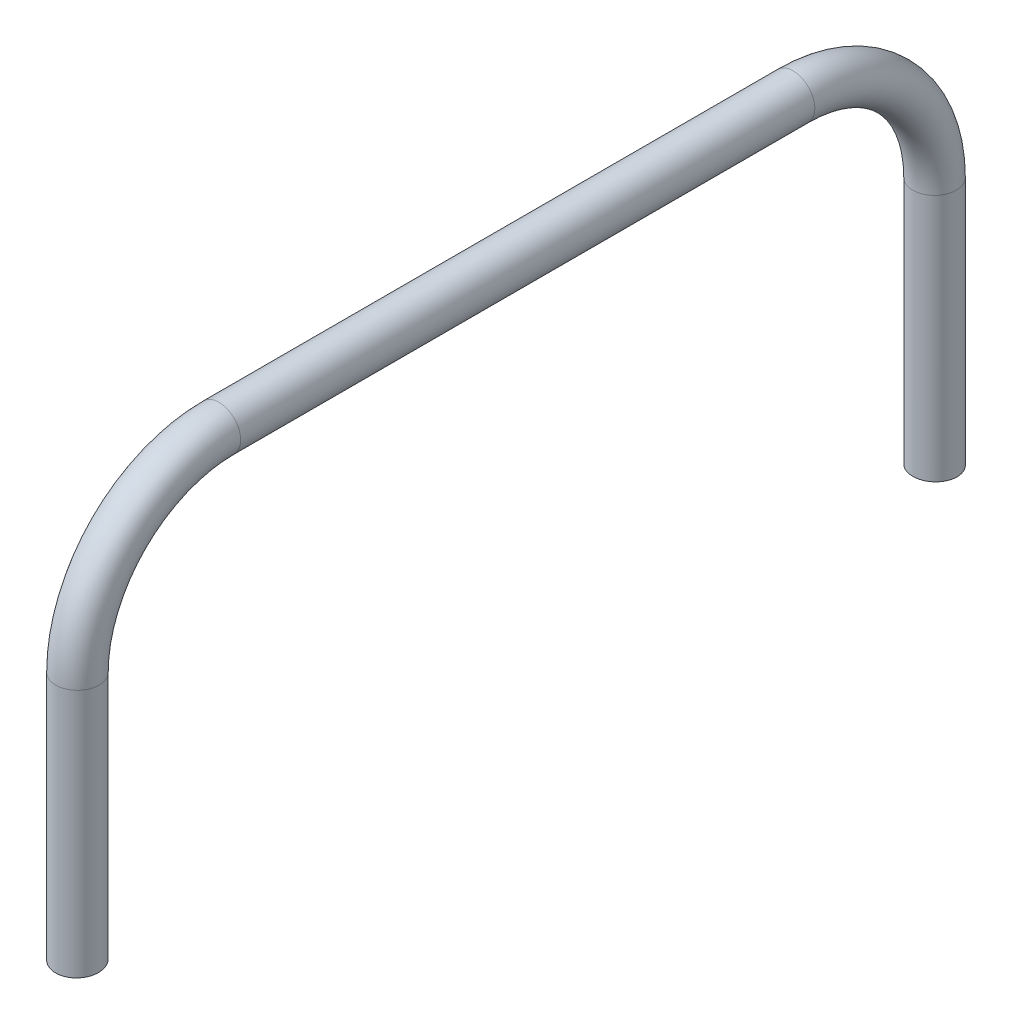
ISO-10303-21;
HEADER;
FILE_DESCRIPTION(('STEP AP214'),'2;1');
FILE_NAME('part.step','',(''),(''),'','','');
FILE_SCHEMA(('AUTOMOTIVE_DESIGN { 1 0 10303 214 1 1 1 1 }'));
ENDSEC;
DATA;
#1=APPLICATION_CONTEXT('core data for automotive mechanical design processes');
#2=APPLICATION_PROTOCOL_DEFINITION('international standard','automotive_design',2000,#1);
#3=PRODUCT_CONTEXT('',#1,'mechanical');
#4=PRODUCT('Part','Part','',(#3));
#5=PRODUCT_RELATED_PRODUCT_CATEGORY('part','',(#4));
#6=PRODUCT_DEFINITION_FORMATION('','',#4);
#7=PRODUCT_DEFINITION_CONTEXT('part definition',#1,'design');
#8=PRODUCT_DEFINITION('design','',#6,#7);
#9=PRODUCT_DEFINITION_SHAPE('','',#8);
#10=(LENGTH_UNIT() NAMED_UNIT(*) SI_UNIT(.MILLI.,.METRE.));
#11=(NAMED_UNIT(*) PLANE_ANGLE_UNIT() SI_UNIT($,.RADIAN.));
#12=(NAMED_UNIT(*) SI_UNIT($,.STERADIAN.) SOLID_ANGLE_UNIT());
#13=UNCERTAINTY_MEASURE_WITH_UNIT(LENGTH_MEASURE(1.E-05),#10,'distance_accuracy_value','');
#14=(GEOMETRIC_REPRESENTATION_CONTEXT(3) GLOBAL_UNCERTAINTY_ASSIGNED_CONTEXT((#13)) GLOBAL_UNIT_ASSIGNED_CONTEXT((#10,
#11,#12)) REPRESENTATION_CONTEXT('',''));
#15=CARTESIAN_POINT('',(0.,0.,0.));
#16=DIRECTION('',(0.,0.,1.));
#17=DIRECTION('',(1.,0.,0.));
#18=AXIS2_PLACEMENT_3D('',#15,#16,#17);
#19=CARTESIAN_POINT('',(899.999999999999,420.499546279117,-167.450000000002));
#20=DIRECTION('',(1.,0.,0.));
#21=DIRECTION('',(0.,0.,-1.));
#22=AXIS2_PLACEMENT_3D('',#19,#20,#21);
#23=TOROIDAL_SURFACE('',#22,82.5499999999968,9.65000000000003);
#24=CARTESIAN_POINT('',(899.999999999999,420.499546279127,-249.999999999998));
#25=DIRECTION('',(0.,1.,1.20409408209324E-13));
#26=DIRECTION('',(0.,-1.20409408209324E-13,1.));
#27=AXIS2_PLACEMENT_3D('',#24,#25,#26);
#28=CIRCLE('',#27,9.65000000000003);
#29=CARTESIAN_POINT('',(899.999999999999,420.499546279128,-259.649999999998));
#30=VERTEX_POINT('',#29);
#31=EDGE_CURVE('E80',#30,#30,#28,.T.);
#32=CARTESIAN_POINT('',(900.,503.049546279118,-167.450000000002));
#33=DIRECTION('',(0.,0.,-1.));
#34=DIRECTION('',(-1.,0.,0.));
#35=AXIS2_PLACEMENT_3D('',#32,#33,#34);
#36=CIRCLE('',#35,9.65000000000003);
#37=CARTESIAN_POINT('',(900.,512.699546279114,-167.450000000002));
#38=VERTEX_POINT('',#37);
#39=EDGE_CURVE('E41',#38,#38,#36,.T.);
#40=CARTESIAN_POINT('',(899.999999999999,420.499546279117,-167.450000000002));
#41=DIRECTION('',(1.,0.,0.));
#42=DIRECTION('',(0.,0.,-1.));
#43=AXIS2_PLACEMENT_3D('',#40,#41,#42);
#44=CIRCLE('',#43,92.1999999999968);
#45=EDGE_CURVE('',#30,#38,#44,.T.);
#46=ORIENTED_EDGE('',*,*,#31,.F.);
#47=ORIENTED_EDGE('',*,*,#39,.F.);
#48=ORIENTED_EDGE('',*,*,#45,.T.);
#49=ORIENTED_EDGE('',*,*,#45,.F.);
#50=EDGE_LOOP('',(#46,#48,#47,#49));
#51=FACE_BOUND('',#50,.T.);
#52=ADVANCED_FACE('F38',(#51),#23,.F.);
#53=CARTESIAN_POINT('',(899.999999999999,420.499546279117,-167.450000000002));
#54=DIRECTION('',(1.,0.,0.));
#55=DIRECTION('',(0.,0.,-1.));
#56=AXIS2_PLACEMENT_3D('',#53,#54,#55);
#57=TOROIDAL_SURFACE('',#56,82.5499999999968,12.7);
#58=CARTESIAN_POINT('',(899.999999999999,420.499546279127,-249.999999999998));
#59=DIRECTION('',(0.,1.,1.20409408209324E-13));
#60=DIRECTION('',(0.,-1.20409408209324E-13,1.));
#61=AXIS2_PLACEMENT_3D('',#58,#59,#60);
#62=CIRCLE('',#61,12.7);
#63=CARTESIAN_POINT('',(899.999999999999,420.499546279129,-262.699999999998));
#64=VERTEX_POINT('',#63);
#65=EDGE_CURVE('E79',#64,#64,#62,.T.);
#66=CARTESIAN_POINT('',(900.,503.049546279118,-167.450000000002));
#67=DIRECTION('',(0.,0.,-1.));
#68=DIRECTION('',(-1.,0.,0.));
#69=AXIS2_PLACEMENT_3D('',#66,#67,#68);
#70=CIRCLE('',#69,12.7);
#71=CARTESIAN_POINT('',(900.,515.749546279114,-167.450000000002));
#72=VERTEX_POINT('',#71);
#73=EDGE_CURVE('E10',#72,#72,#70,.T.);
#74=CARTESIAN_POINT('',(899.999999999999,420.499546279117,-167.450000000002));
#75=DIRECTION('',(1.,0.,0.));
#76=DIRECTION('',(0.,0.,-1.));
#77=AXIS2_PLACEMENT_3D('',#74,#75,#76);
#78=CIRCLE('',#77,95.2499999999968);
#79=EDGE_CURVE('',#64,#72,#78,.T.);
#80=ORIENTED_EDGE('',*,*,#65,.T.);
#81=ORIENTED_EDGE('',*,*,#73,.T.);
#82=ORIENTED_EDGE('',*,*,#79,.T.);
#83=ORIENTED_EDGE('',*,*,#79,.F.);
#84=EDGE_LOOP('',(#80,#82,#81,#83));
#85=FACE_BOUND('',#84,.T.);
#86=ADVANCED_FACE('F97',(#85),#57,.T.);
#87=CARTESIAN_POINT('',(900.,503.049546279118,167.449999999999));
#88=DIRECTION('',(0.,0.,-1.));
#89=DIRECTION('',(-1.,0.,0.));
#90=AXIS2_PLACEMENT_3D('',#87,#88,#89);
#91=CYLINDRICAL_SURFACE('',#90,9.65000000000003);
#92=CARTESIAN_POINT('',(900.,503.049546279118,167.449999999999));
#93=DIRECTION('',(0.,0.,-1.));
#94=DIRECTION('',(-1.,0.,0.));
#95=AXIS2_PLACEMENT_3D('',#92,#93,#94);
#96=CIRCLE('',#95,9.65000000000003);
#97=CARTESIAN_POINT('',(900.,512.699546279118,167.449999999999));
#98=VERTEX_POINT('',#97);
#99=EDGE_CURVE('E54',#98,#98,#96,.T.);
#100=ORIENTED_EDGE('',*,*,#99,.F.);
#101=EDGE_LOOP('',(#100));
#102=FACE_BOUND('',#101,.T.);
#103=ORIENTED_EDGE('',*,*,#39,.T.);
#104=EDGE_LOOP('',(#103));
#105=FACE_BOUND('',#104,.T.);
#106=ADVANCED_FACE('F103',(#102,#105),#91,.F.);
#107=CARTESIAN_POINT('',(900.,503.049546279118,167.449999999999));
#108=DIRECTION('',(0.,0.,-1.));
#109=DIRECTION('',(-1.,0.,0.));
#110=AXIS2_PLACEMENT_3D('',#107,#108,#109);
#111=CYLINDRICAL_SURFACE('',#110,12.7);
#112=CARTESIAN_POINT('',(900.,503.049546279118,167.449999999999));
#113=DIRECTION('',(0.,0.,1.));
#114=DIRECTION('',(1.,0.,0.));
#115=AXIS2_PLACEMENT_3D('',#112,#113,#114);
#116=CIRCLE('',#115,12.7);
#117=CARTESIAN_POINT('',(900.,515.749546279118,167.449999999999));
#118=VERTEX_POINT('',#117);
#119=EDGE_CURVE('E46',#118,#118,#116,.T.);
#120=ORIENTED_EDGE('',*,*,#119,.F.);
#121=EDGE_LOOP('',(#120));
#122=FACE_BOUND('',#121,.T.);
#123=ORIENTED_EDGE('',*,*,#73,.F.);
#124=EDGE_LOOP('',(#123));
#125=FACE_BOUND('',#124,.T.);
#126=ADVANCED_FACE('F109',(#122,#125),#111,.T.);
#127=CARTESIAN_POINT('',(900.,420.499546279117,167.449999999999));
#128=DIRECTION('',(1.,0.,0.));
#129=DIRECTION('',(0.,0.,-1.));
#130=AXIS2_PLACEMENT_3D('',#127,#128,#129);
#131=TOROIDAL_SURFACE('',#130,82.5500000000009,9.65000000000003);
#132=CARTESIAN_POINT('',(899.999999999999,420.499546279117,249.999999999998));
#133=DIRECTION('',(0.,1.,0.));
#134=DIRECTION('',(-1.,0.,0.));
#135=AXIS2_PLACEMENT_3D('',#132,#133,#134);
#136=CIRCLE('',#135,9.65000000000003);
#137=CARTESIAN_POINT('',(899.999999999999,420.499546279117,259.65));
#138=VERTEX_POINT('',#137);
#139=EDGE_CURVE('E63',#138,#138,#136,.T.);
#140=CARTESIAN_POINT('',(900.,420.499546279117,167.449999999999));
#141=DIRECTION('',(1.,0.,0.));
#142=DIRECTION('',(0.,0.,-1.));
#143=AXIS2_PLACEMENT_3D('',#140,#141,#142);
#144=CIRCLE('',#143,92.2000000000009);
#145=EDGE_CURVE('',#98,#138,#144,.T.);
#146=ORIENTED_EDGE('',*,*,#99,.T.);
#147=ORIENTED_EDGE('',*,*,#139,.F.);
#148=ORIENTED_EDGE('',*,*,#145,.T.);
#149=ORIENTED_EDGE('',*,*,#145,.F.);
#150=EDGE_LOOP('',(#146,#148,#147,#149));
#151=FACE_BOUND('',#150,.T.);
#152=ADVANCED_FACE('F116',(#151),#131,.F.);
#153=CARTESIAN_POINT('',(900.,420.499546279117,167.449999999999));
#154=DIRECTION('',(1.,0.,0.));
#155=DIRECTION('',(0.,0.,-1.));
#156=AXIS2_PLACEMENT_3D('',#153,#154,#155);
#157=TOROIDAL_SURFACE('',#156,82.5500000000009,12.7);
#158=CARTESIAN_POINT('',(899.999999999999,420.499546279117,249.999999999998));
#159=DIRECTION('',(0.,1.,0.));
#160=DIRECTION('',(-1.,0.,0.));
#161=AXIS2_PLACEMENT_3D('',#158,#159,#160);
#162=CIRCLE('',#161,12.7);
#163=CARTESIAN_POINT('',(899.999999999999,420.499546279117,262.7));
#164=VERTEX_POINT('',#163);
#165=EDGE_CURVE('E67',#164,#164,#162,.T.);
#166=CARTESIAN_POINT('',(900.,420.499546279117,167.449999999999));
#167=DIRECTION('',(1.,0.,0.));
#168=DIRECTION('',(0.,0.,-1.));
#169=AXIS2_PLACEMENT_3D('',#166,#167,#168);
#170=CIRCLE('',#169,95.2500000000009);
#171=EDGE_CURVE('',#118,#164,#170,.T.);
#172=ORIENTED_EDGE('',*,*,#119,.T.);
#173=ORIENTED_EDGE('',*,*,#165,.T.);
#174=ORIENTED_EDGE('',*,*,#171,.T.);
#175=ORIENTED_EDGE('',*,*,#171,.F.);
#176=EDGE_LOOP('',(#172,#174,#173,#175));
#177=FACE_BOUND('',#176,.T.);
#178=ADVANCED_FACE('F123',(#177),#157,.T.);
#179=CARTESIAN_POINT('',(899.999999999994,275.499546279119,249.999999999999));
#180=DIRECTION('',(0.,1.,0.));
#181=DIRECTION('',(-1.,0.,0.));
#182=AXIS2_PLACEMENT_3D('',#179,#180,#181);
#183=CYLINDRICAL_SURFACE('',#182,9.65000000000003);
#184=CARTESIAN_POINT('',(899.999999999994,275.499546279119,249.999999999999));
#185=DIRECTION('',(0.00229816078026698,0.999408736415618,0.0343059183402114));
#186=DIRECTION('',(-0.0668008812384672,0.0343828093112999,-0.997173738467689));
#187=AXIS2_PLACEMENT_3D('',#184,#185,#186);
#188=ELLIPSE('',#187,9.65570906915401,9.65000000000003);
#189=CARTESIAN_POINT('',(899.354990125192,275.831536682809,240.371580489954));
#190=VERTEX_POINT('',#189);
#191=EDGE_CURVE('E62',#190,#190,#188,.T.);
#192=ORIENTED_EDGE('',*,*,#191,.F.);
#193=EDGE_LOOP('',(#192));
#194=FACE_BOUND('',#193,.T.);
#195=ORIENTED_EDGE('',*,*,#139,.T.);
#196=EDGE_LOOP('',(#195));
#197=FACE_BOUND('',#196,.T.);
#198=ADVANCED_FACE('F127',(#194,#197),#183,.F.);
#199=CARTESIAN_POINT('',(899.999999999994,275.499546279119,249.999999999999));
#200=DIRECTION('',(0.,1.,0.));
#201=DIRECTION('',(-1.,0.,0.));
#202=AXIS2_PLACEMENT_3D('',#199,#200,#201);
#203=CYLINDRICAL_SURFACE('',#202,12.7);
#204=CARTESIAN_POINT('',(899.999999999994,275.499546279119,249.999999999999));
#205=DIRECTION('',(0.00229816078026698,0.999408736415618,0.0343059183402114));
#206=DIRECTION('',(-0.0668008812384672,0.0343828093112999,-0.997173738467689));
#207=AXIS2_PLACEMENT_3D('',#204,#205,#206);
#208=ELLIPSE('',#207,12.7075134899746,12.7);
#209=CARTESIAN_POINT('',(899.151126900514,275.936466292265,237.328401266572));
#210=VERTEX_POINT('',#209);
#211=EDGE_CURVE('E58',#210,#210,#208,.T.);
#212=ORIENTED_EDGE('',*,*,#211,.T.);
#213=EDGE_LOOP('',(#212));
#214=FACE_BOUND('',#213,.T.);
#215=ORIENTED_EDGE('',*,*,#165,.F.);
#216=EDGE_LOOP('',(#215));
#217=FACE_BOUND('',#216,.T.);
#218=ADVANCED_FACE('F129',(#214,#217),#203,.T.);
#219=CARTESIAN_POINT('',(899.999999999994,275.499546279119,249.999999999999));
#220=DIRECTION('',(0.00229816078026698,0.999408736415618,0.0343059183402114));
#221=DIRECTION('',(0.,-0.0343060089346612,0.999411375636167));
#222=AXIS2_PLACEMENT_3D('',#219,#220,#221);
#223=PLANE('',#222);
#224=ORIENTED_EDGE('',*,*,#191,.T.);
#225=EDGE_LOOP('',(#224));
#226=FACE_BOUND('',#225,.T.);
#227=ORIENTED_EDGE('',*,*,#211,.F.);
#228=EDGE_LOOP('',(#227));
#229=FACE_BOUND('',#228,.T.);
#230=ADVANCED_FACE('F132',(#226,#229),#223,.F.);
#231=CARTESIAN_POINT('',(899.999999999999,420.499546279127,-249.999999999998));
#232=DIRECTION('',(0.,-1.,0.));
#233=DIRECTION('',(0.,0.,-1.));
#234=AXIS2_PLACEMENT_3D('',#231,#232,#233);
#235=CYLINDRICAL_SURFACE('',#234,9.65000000000003);
#236=ORIENTED_EDGE('',*,*,#31,.T.);
#237=EDGE_LOOP('',(#236));
#238=FACE_BOUND('',#237,.T.);
#239=CARTESIAN_POINT('',(899.999999999999,275.499546279119,-249.999999999998));
#240=DIRECTION('',(-0.00229816078025704,-0.999408736415632,0.034305918339809));
#241=DIRECTION('',(0.0668008812400526,-0.0343828093108978,-0.997173738467597));
#242=AXIS2_PLACEMENT_3D('',#239,#240,#241);
#243=ELLIPSE('',#242,9.65570906915387,9.65000000000003);
#244=CARTESIAN_POINT('',(900.645009874817,275.167555875433,-259.628419510042));
#245=VERTEX_POINT('',#244);
#246=EDGE_CURVE('E75',#245,#245,#243,.T.);
#247=ORIENTED_EDGE('',*,*,#246,.T.);
#248=EDGE_LOOP('',(#247));
#249=FACE_BOUND('',#248,.T.);
#250=ADVANCED_FACE('F93',(#238,#249),#235,.F.);
#251=CARTESIAN_POINT('',(899.999999999999,420.499546279127,-249.999999999998));
#252=DIRECTION('',(0.,-1.,0.));
#253=DIRECTION('',(0.,0.,-1.));
#254=AXIS2_PLACEMENT_3D('',#251,#252,#253);
#255=CYLINDRICAL_SURFACE('',#254,12.7);
#256=ORIENTED_EDGE('',*,*,#65,.F.);
#257=EDGE_LOOP('',(#256));
#258=FACE_BOUND('',#257,.T.);
#259=CARTESIAN_POINT('',(899.999999999999,275.499546279119,-249.999999999998));
#260=DIRECTION('',(-0.00229816078025704,-0.999408736415632,0.034305918339809));
#261=DIRECTION('',(0.0668008812400526,-0.0343828093108978,-0.997173738467597));
#262=AXIS2_PLACEMENT_3D('',#259,#260,#261);
#263=ELLIPSE('',#262,12.7075134899745,12.7);
#264=CARTESIAN_POINT('',(900.8488730995,275.062626265978,-262.671598733424));
#265=VERTEX_POINT('',#264);
#266=EDGE_CURVE('E68',#265,#265,#263,.T.);
#267=ORIENTED_EDGE('',*,*,#266,.F.);
#268=EDGE_LOOP('',(#267));
#269=FACE_BOUND('',#268,.T.);
#270=ADVANCED_FACE('F143',(#258,#269),#255,.T.);
#271=CARTESIAN_POINT('',(899.999999999999,275.499546279119,-249.999999999998));
#272=DIRECTION('',(-0.00229816078025704,-0.999408736415632,0.034305918339809));
#273=DIRECTION('',(0.,-0.0343060089342588,-0.99941137563618));
#274=AXIS2_PLACEMENT_3D('',#271,#272,#273);
#275=PLANE('',#274);
#276=ORIENTED_EDGE('',*,*,#246,.F.);
#277=EDGE_LOOP('',(#276));
#278=FACE_BOUND('',#277,.T.);
#279=ORIENTED_EDGE('',*,*,#266,.T.);
#280=EDGE_LOOP('',(#279));
#281=FACE_BOUND('',#280,.T.);
#282=ADVANCED_FACE('F140',(#278,#281),#275,.T.);
#283=CLOSED_SHELL('',(#52,#86,#106,#126,#152,#178,#198,#218,#230,#250,#270,#282));
#284=MANIFOLD_SOLID_BREP('B2',#283);
#285=ADVANCED_BREP_SHAPE_REPRESENTATION('',(#18,#284),#14);
#286=SHAPE_DEFINITION_REPRESENTATION(#9,#285);
ENDSEC;
END-ISO-10303-21;
